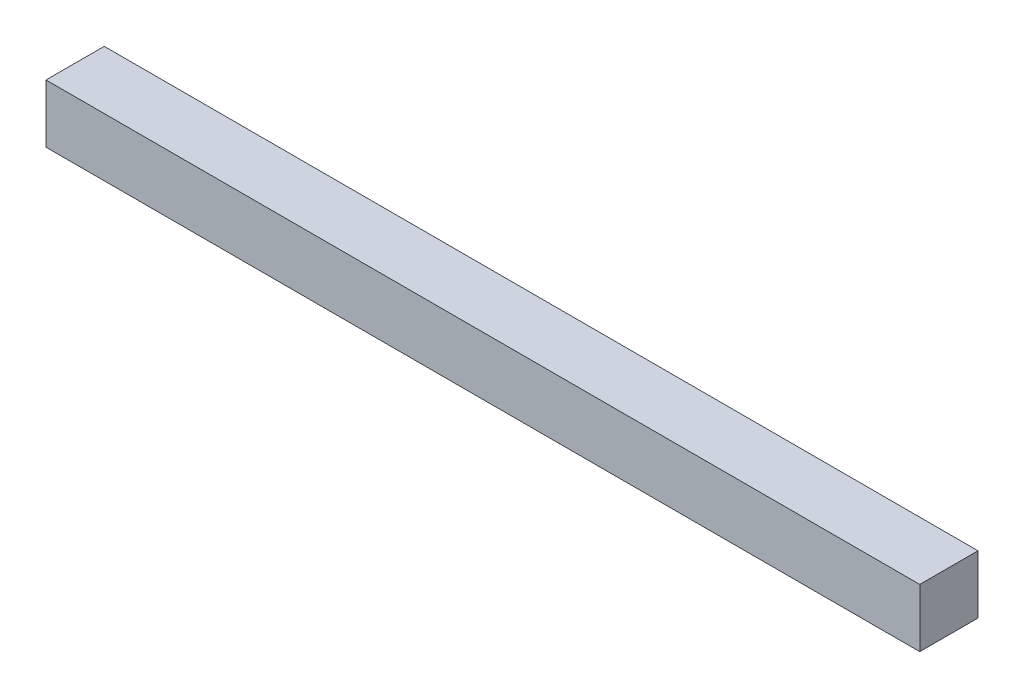
ISO-10303-21;
HEADER;
FILE_DESCRIPTION(('STEP AP214'),'2;1');
FILE_NAME('part.step','',(''),(''),'','','');
FILE_SCHEMA(('AUTOMOTIVE_DESIGN { 1 0 10303 214 1 1 1 1 }'));
ENDSEC;
DATA;
#1=APPLICATION_CONTEXT('core data for automotive mechanical design processes');
#2=APPLICATION_PROTOCOL_DEFINITION('international standard','automotive_design',2000,#1);
#3=PRODUCT_CONTEXT('',#1,'mechanical');
#4=PRODUCT('Part','Part','',(#3));
#5=PRODUCT_RELATED_PRODUCT_CATEGORY('part','',(#4));
#6=PRODUCT_DEFINITION_FORMATION('','',#4);
#7=PRODUCT_DEFINITION_CONTEXT('part definition',#1,'design');
#8=PRODUCT_DEFINITION('design','',#6,#7);
#9=PRODUCT_DEFINITION_SHAPE('','',#8);
#10=(LENGTH_UNIT() NAMED_UNIT(*) SI_UNIT(.MILLI.,.METRE.));
#11=(NAMED_UNIT(*) PLANE_ANGLE_UNIT() SI_UNIT($,.RADIAN.));
#12=(NAMED_UNIT(*) SI_UNIT($,.STERADIAN.) SOLID_ANGLE_UNIT());
#13=UNCERTAINTY_MEASURE_WITH_UNIT(LENGTH_MEASURE(1.E-05),#10,'distance_accuracy_value','');
#14=(GEOMETRIC_REPRESENTATION_CONTEXT(3) GLOBAL_UNCERTAINTY_ASSIGNED_CONTEXT((#13)) GLOBAL_UNIT_ASSIGNED_CONTEXT((#10,
#11,#12)) REPRESENTATION_CONTEXT('',''));
#15=CARTESIAN_POINT('',(0.,0.,0.));
#16=DIRECTION('',(0.,0.,1.));
#17=DIRECTION('',(1.,0.,0.));
#18=AXIS2_PLACEMENT_3D('',#15,#16,#17);
#19=CARTESIAN_POINT('',(-381.,-25.4,50.8));
#20=DIRECTION('',(1.,0.,0.));
#21=DIRECTION('',(0.,0.,-1.));
#22=AXIS2_PLACEMENT_3D('',#19,#20,#21);
#23=PLANE('',#22);
#24=DIRECTION('',(0.,-1.,0.));
#25=VECTOR('',#24,1.);
#26=CARTESIAN_POINT('',(-381.,-25.4,0.));
#27=LINE('',#26,#25);
#28=CARTESIAN_POINT('',(-381.,25.4,0.));
#29=VERTEX_POINT('',#28);
#30=CARTESIAN_POINT('',(-381.,-25.4,0.));
#31=VERTEX_POINT('',#30);
#32=EDGE_CURVE('E113',#29,#31,#27,.T.);
#33=ORIENTED_EDGE('',*,*,#32,.T.);
#34=DIRECTION('',(0.,0.,-1.));
#35=VECTOR('',#34,1.);
#36=CARTESIAN_POINT('',(-381.,-25.4,50.8));
#37=LINE('',#36,#35);
#38=CARTESIAN_POINT('',(-381.,-25.4,50.8));
#39=VERTEX_POINT('',#38);
#40=EDGE_CURVE('E11',#39,#31,#37,.T.);
#41=ORIENTED_EDGE('',*,*,#40,.F.);
#42=DIRECTION('',(0.,-1.,0.));
#43=VECTOR('',#42,1.);
#44=CARTESIAN_POINT('',(-381.,-25.4,50.8));
#45=LINE('',#44,#43);
#46=CARTESIAN_POINT('',(-381.,25.4,50.8));
#47=VERTEX_POINT('',#46);
#48=EDGE_CURVE('E97',#47,#39,#45,.T.);
#49=ORIENTED_EDGE('',*,*,#48,.F.);
#50=DIRECTION('',(0.,0.,-1.));
#51=VECTOR('',#50,1.);
#52=CARTESIAN_POINT('',(-381.,25.4,50.8));
#53=LINE('',#52,#51);
#54=EDGE_CURVE('E109',#47,#29,#53,.T.);
#55=ORIENTED_EDGE('',*,*,#54,.T.);
#56=EDGE_LOOP('',(#33,#41,#49,#55));
#57=FACE_BOUND('',#56,.T.);
#58=ADVANCED_FACE('F45',(#57),#23,.F.);
#59=CARTESIAN_POINT('',(381.,-25.3999999999999,50.8));
#60=DIRECTION('',(0.,1.,0.));
#61=DIRECTION('',(-1.,0.,0.));
#62=AXIS2_PLACEMENT_3D('',#59,#60,#61);
#63=PLANE('',#62);
#64=DIRECTION('',(1.,0.,0.));
#65=VECTOR('',#64,1.);
#66=CARTESIAN_POINT('',(381.,-25.3999999999999,0.));
#67=LINE('',#66,#65);
#68=CARTESIAN_POINT('',(381.,-25.3999999999999,0.));
#69=VERTEX_POINT('',#68);
#70=EDGE_CURVE('E102',#31,#69,#67,.T.);
#71=ORIENTED_EDGE('',*,*,#70,.T.);
#72=DIRECTION('',(0.,0.,-1.));
#73=VECTOR('',#72,1.);
#74=CARTESIAN_POINT('',(381.,-25.3999999999999,50.8));
#75=LINE('',#74,#73);
#76=CARTESIAN_POINT('',(381.,-25.3999999999999,50.8));
#77=VERTEX_POINT('',#76);
#78=EDGE_CURVE('E54',#77,#69,#75,.T.);
#79=ORIENTED_EDGE('',*,*,#78,.F.);
#80=DIRECTION('',(1.,0.,0.));
#81=VECTOR('',#80,1.);
#82=CARTESIAN_POINT('',(381.,-25.3999999999999,50.8));
#83=LINE('',#82,#81);
#84=EDGE_CURVE('E92',#39,#77,#83,.T.);
#85=ORIENTED_EDGE('',*,*,#84,.F.);
#86=ORIENTED_EDGE('',*,*,#40,.T.);
#87=EDGE_LOOP('',(#71,#79,#85,#86));
#88=FACE_BOUND('',#87,.T.);
#89=ADVANCED_FACE('F101',(#88),#63,.F.);
#90=CARTESIAN_POINT('',(381.,-25.3999999999999,50.8));
#91=DIRECTION('',(-1.,0.,0.));
#92=DIRECTION('',(0.,0.,1.));
#93=AXIS2_PLACEMENT_3D('',#90,#91,#92);
#94=PLANE('',#93);
#95=DIRECTION('',(0.,1.,0.));
#96=VECTOR('',#95,1.);
#97=CARTESIAN_POINT('',(381.,-25.3999999999999,0.));
#98=LINE('',#97,#96);
#99=CARTESIAN_POINT('',(381.,25.4000000000001,0.));
#100=VERTEX_POINT('',#99);
#101=EDGE_CURVE('E79',#69,#100,#98,.T.);
#102=ORIENTED_EDGE('',*,*,#101,.T.);
#103=DIRECTION('',(0.,0.,-1.));
#104=VECTOR('',#103,1.);
#105=CARTESIAN_POINT('',(381.,25.4000000000001,50.8));
#106=LINE('',#105,#104);
#107=CARTESIAN_POINT('',(381.,25.4000000000001,50.8));
#108=VERTEX_POINT('',#107);
#109=EDGE_CURVE('E104',#108,#100,#106,.T.);
#110=ORIENTED_EDGE('',*,*,#109,.F.);
#111=DIRECTION('',(0.,1.,0.));
#112=VECTOR('',#111,1.);
#113=CARTESIAN_POINT('',(381.,-25.3999999999999,50.8));
#114=LINE('',#113,#112);
#115=EDGE_CURVE('E95',#77,#108,#114,.T.);
#116=ORIENTED_EDGE('',*,*,#115,.F.);
#117=ORIENTED_EDGE('',*,*,#78,.T.);
#118=EDGE_LOOP('',(#102,#110,#116,#117));
#119=FACE_BOUND('',#118,.T.);
#120=ADVANCED_FACE('F105',(#119),#94,.F.);
#121=CARTESIAN_POINT('',(381.,25.4000000000001,50.8));
#122=DIRECTION('',(0.,-1.,0.));
#123=DIRECTION('',(1.,0.,0.));
#124=AXIS2_PLACEMENT_3D('',#121,#122,#123);
#125=PLANE('',#124);
#126=DIRECTION('',(-1.,0.,0.));
#127=VECTOR('',#126,1.);
#128=CARTESIAN_POINT('',(381.,25.4000000000001,0.));
#129=LINE('',#128,#127);
#130=EDGE_CURVE('E85',#100,#29,#129,.T.);
#131=ORIENTED_EDGE('',*,*,#130,.T.);
#132=ORIENTED_EDGE('',*,*,#54,.F.);
#133=DIRECTION('',(-1.,0.,0.));
#134=VECTOR('',#133,1.);
#135=CARTESIAN_POINT('',(381.,25.4000000000001,50.8));
#136=LINE('',#135,#134);
#137=EDGE_CURVE('E62',#108,#47,#136,.T.);
#138=ORIENTED_EDGE('',*,*,#137,.F.);
#139=ORIENTED_EDGE('',*,*,#109,.T.);
#140=EDGE_LOOP('',(#131,#132,#138,#139));
#141=FACE_BOUND('',#140,.T.);
#142=ADVANCED_FACE('F126',(#141),#125,.F.);
#143=CARTESIAN_POINT('',(0.,0.,50.8));
#144=DIRECTION('',(0.,0.,1.));
#145=DIRECTION('',(1.,0.,0.));
#146=AXIS2_PLACEMENT_3D('',#143,#144,#145);
#147=PLANE('',#146);
#148=ORIENTED_EDGE('',*,*,#48,.T.);
#149=ORIENTED_EDGE('',*,*,#84,.T.);
#150=ORIENTED_EDGE('',*,*,#115,.T.);
#151=ORIENTED_EDGE('',*,*,#137,.T.);
#152=EDGE_LOOP('',(#148,#149,#150,#151));
#153=FACE_BOUND('',#152,.T.);
#154=ADVANCED_FACE('F93',(#153),#147,.T.);
#155=CARTESIAN_POINT('',(0.,0.,0.));
#156=DIRECTION('',(0.,0.,1.));
#157=DIRECTION('',(1.,0.,0.));
#158=AXIS2_PLACEMENT_3D('',#155,#156,#157);
#159=PLANE('',#158);
#160=ORIENTED_EDGE('',*,*,#32,.F.);
#161=ORIENTED_EDGE('',*,*,#130,.F.);
#162=ORIENTED_EDGE('',*,*,#101,.F.);
#163=ORIENTED_EDGE('',*,*,#70,.F.);
#164=EDGE_LOOP('',(#160,#161,#162,#163));
#165=FACE_BOUND('',#164,.T.);
#166=ADVANCED_FACE('F129',(#165),#159,.F.);
#167=CLOSED_SHELL('',(#58,#89,#120,#142,#154,#166));
#168=MANIFOLD_SOLID_BREP('B2',#167);
#169=ADVANCED_BREP_SHAPE_REPRESENTATION('',(#18,#168),#14);
#170=SHAPE_DEFINITION_REPRESENTATION(#9,#169);
ENDSEC;
END-ISO-10303-21;
